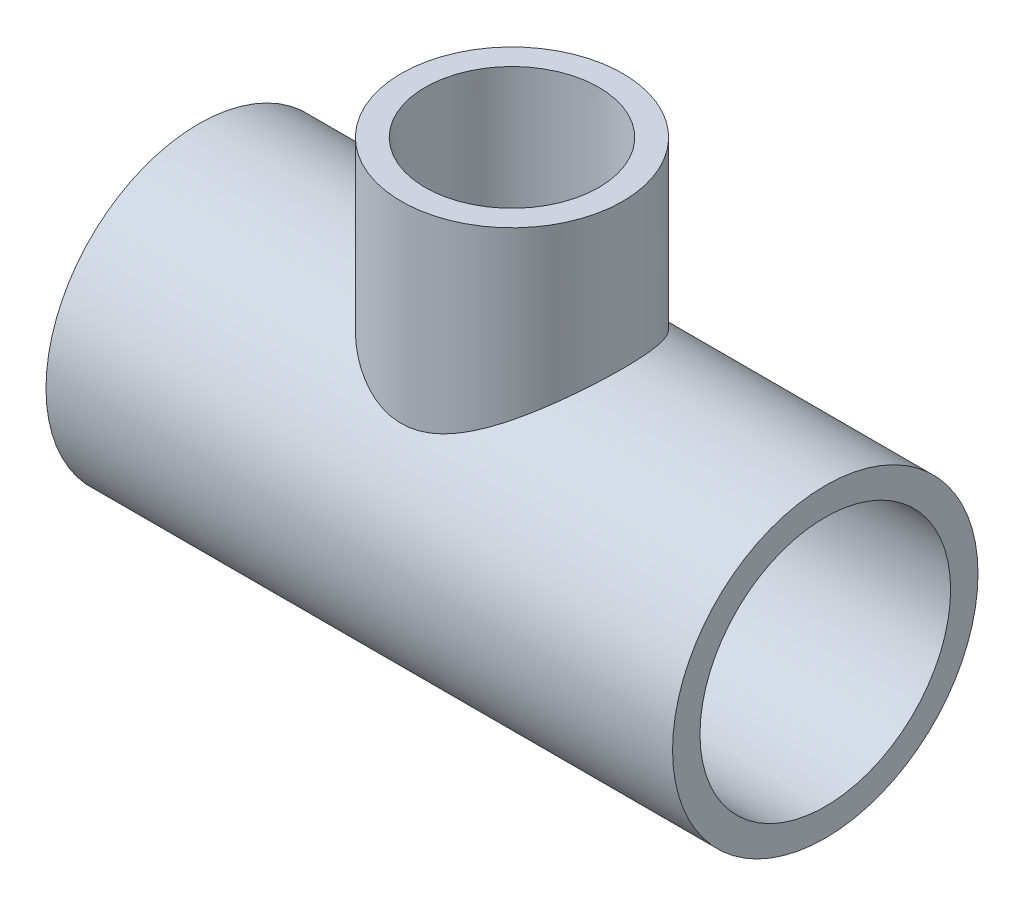
ISO-10303-21;
HEADER;
FILE_DESCRIPTION(('STEP AP214'),'2;1');
FILE_NAME('part.step','',(''),(''),'','','');
FILE_SCHEMA(('AUTOMOTIVE_DESIGN { 1 0 10303 214 1 1 1 1 }'));
ENDSEC;
DATA;
#1=APPLICATION_CONTEXT('core data for automotive mechanical design processes');
#2=APPLICATION_PROTOCOL_DEFINITION('international standard','automotive_design',2000,#1);
#3=PRODUCT_CONTEXT('',#1,'mechanical');
#4=PRODUCT('Part','Part','',(#3));
#5=PRODUCT_RELATED_PRODUCT_CATEGORY('part','',(#4));
#6=PRODUCT_DEFINITION_FORMATION('','',#4);
#7=PRODUCT_DEFINITION_CONTEXT('part definition',#1,'design');
#8=PRODUCT_DEFINITION('design','',#6,#7);
#9=PRODUCT_DEFINITION_SHAPE('','',#8);
#10=(LENGTH_UNIT() NAMED_UNIT(*) SI_UNIT(.MILLI.,.METRE.));
#11=(NAMED_UNIT(*) PLANE_ANGLE_UNIT() SI_UNIT($,.RADIAN.));
#12=(NAMED_UNIT(*) SI_UNIT($,.STERADIAN.) SOLID_ANGLE_UNIT());
#13=UNCERTAINTY_MEASURE_WITH_UNIT(LENGTH_MEASURE(1.E-05),#10,'distance_accuracy_value','');
#14=(GEOMETRIC_REPRESENTATION_CONTEXT(3) GLOBAL_UNCERTAINTY_ASSIGNED_CONTEXT((#13)) GLOBAL_UNIT_ASSIGNED_CONTEXT((#10,
#11,#12)) REPRESENTATION_CONTEXT('',''));
#15=CARTESIAN_POINT('',(0.,0.,0.));
#16=DIRECTION('',(0.,0.,1.));
#17=DIRECTION('',(1.,0.,0.));
#18=AXIS2_PLACEMENT_3D('',#15,#16,#17);
#19=CARTESIAN_POINT('',(-25.654,0.,0.));
#20=DIRECTION('',(1.,0.,0.));
#21=DIRECTION('',(0.,0.,-1.));
#22=AXIS2_PLACEMENT_3D('',#19,#20,#21);
#23=PLANE('',#22);
#24=CARTESIAN_POINT('',(-25.654,0.,0.));
#25=DIRECTION('',(-1.,0.,0.));
#26=DIRECTION('',(0.,0.,1.));
#27=AXIS2_PLACEMENT_3D('',#24,#25,#26);
#28=CIRCLE('',#27,24.0538);
#29=CARTESIAN_POINT('',(-25.654,0.,24.0538));
#30=VERTEX_POINT('',#29);
#31=EDGE_CURVE('E97',#30,#30,#28,.T.);
#32=ORIENTED_EDGE('',*,*,#31,.T.);
#33=EDGE_LOOP('',(#32));
#34=FACE_BOUND('',#33,.T.);
#35=CARTESIAN_POINT('',(-25.654,0.,0.));
#36=DIRECTION('',(1.,0.,0.));
#37=DIRECTION('',(0.,0.,-1.));
#38=AXIS2_PLACEMENT_3D('',#35,#36,#37);
#39=CIRCLE('',#38,19.05);
#40=CARTESIAN_POINT('',(-25.654,0.,-19.05));
#41=VERTEX_POINT('',#40);
#42=EDGE_CURVE('E100',#41,#41,#39,.T.);
#43=ORIENTED_EDGE('',*,*,#42,.T.);
#44=EDGE_LOOP('',(#43));
#45=FACE_BOUND('',#44,.T.);
#46=ADVANCED_FACE('F32',(#34,#45),#23,.F.);
#47=CARTESIAN_POINT('',(25.654,0.,0.));
#48=DIRECTION('',(1.,0.,0.));
#49=DIRECTION('',(0.,0.,-1.));
#50=AXIS2_PLACEMENT_3D('',#47,#48,#49);
#51=PLANE('',#50);
#52=CARTESIAN_POINT('',(25.654,0.,0.));
#53=DIRECTION('',(1.,0.,0.));
#54=DIRECTION('',(0.,0.,-1.));
#55=AXIS2_PLACEMENT_3D('',#52,#53,#54);
#56=CIRCLE('',#55,24.0538);
#57=CARTESIAN_POINT('',(25.654,0.,-24.0538));
#58=VERTEX_POINT('',#57);
#59=EDGE_CURVE('E10',#58,#58,#56,.F.);
#60=ORIENTED_EDGE('',*,*,#59,.F.);
#61=EDGE_LOOP('',(#60));
#62=FACE_BOUND('',#61,.T.);
#63=CARTESIAN_POINT('',(25.654,0.,0.));
#64=DIRECTION('',(1.,0.,0.));
#65=DIRECTION('',(0.,0.,-1.));
#66=AXIS2_PLACEMENT_3D('',#63,#64,#65);
#67=CIRCLE('',#66,19.05);
#68=CARTESIAN_POINT('',(25.654,0.,-19.05));
#69=VERTEX_POINT('',#68);
#70=EDGE_CURVE('E103',#69,#69,#67,.T.);
#71=ORIENTED_EDGE('',*,*,#70,.F.);
#72=EDGE_LOOP('',(#71));
#73=FACE_BOUND('',#72,.T.);
#74=ADVANCED_FACE('F73',(#62,#73),#51,.T.);
#75=CARTESIAN_POINT('',(25.654,0.,0.));
#76=DIRECTION('',(-1.,0.,0.));
#77=DIRECTION('',(0.,0.,1.));
#78=AXIS2_PLACEMENT_3D('',#75,#76,#77);
#79=CYLINDRICAL_SURFACE('',#78,29.591);
#80=CARTESIAN_POINT('',(-60.706,0.,0.));
#81=DIRECTION('',(-1.,0.,0.));
#82=DIRECTION('',(0.,0.,1.));
#83=AXIS2_PLACEMENT_3D('',#80,#81,#82);
#84=CIRCLE('',#83,29.591);
#85=CARTESIAN_POINT('',(-60.706,0.,29.591));
#86=VERTEX_POINT('',#85);
#87=EDGE_CURVE('E114',#86,#86,#84,.T.);
#88=ORIENTED_EDGE('',*,*,#87,.F.);
#89=EDGE_LOOP('',(#88));
#90=FACE_BOUND('',#89,.T.);
#91=CARTESIAN_POINT('',(60.706,0.,0.));
#92=DIRECTION('',(-1.,0.,0.));
#93=DIRECTION('',(0.,0.,1.));
#94=AXIS2_PLACEMENT_3D('',#91,#92,#93);
#95=CIRCLE('',#94,29.591);
#96=CARTESIAN_POINT('',(60.706,0.,29.591));
#97=VERTEX_POINT('',#96);
#98=EDGE_CURVE('E102',#97,#97,#95,.T.);
#99=ORIENTED_EDGE('',*,*,#98,.T.);
#100=EDGE_LOOP('',(#99));
#101=FACE_BOUND('',#100,.T.);
#102=CARTESIAN_POINT('',(21.463,29.591,0.));
#103=CARTESIAN_POINT('',(21.462994898184,29.5909951098971,-0.528338398891371));
#104=CARTESIAN_POINT('',(21.4434549580489,29.5768140730782,-1.05684835625253));
#105=CARTESIAN_POINT('',(21.3655887204457,29.5204097931558,-2.10973586915896));
#106=CARTESIAN_POINT('',(21.3072371146965,29.4781682524034,-2.63411050223786));
#107=CARTESIAN_POINT('',(21.152501873962,29.3665178540433,-3.67556796864868));
#108=CARTESIAN_POINT('',(21.0560282203728,29.2970446968459,-4.19263052053947));
#109=CARTESIAN_POINT('',(20.826557375346,29.1325593081479,-5.21430839745557));
#110=CARTESIAN_POINT('',(20.693565673549,29.0375509153227,-5.71892558093717));
#111=CARTESIAN_POINT('',(20.393821315668,28.8247080893867,-6.70959467389816));
#112=CARTESIAN_POINT('',(20.2272761479536,28.7070141242889,-7.19573985653992));
#113=CARTESIAN_POINT('',(19.8619688391845,28.4507955926621,-8.15007104952323));
#114=CARTESIAN_POINT('',(19.6632055890514,28.3122703090456,-8.6182564409287));
#115=CARTESIAN_POINT('',(19.2356833404562,28.0170400727261,-9.53437191154692));
#116=CARTESIAN_POINT('',(19.0069415278178,27.8603455418026,-9.98231339961891));
#117=CARTESIAN_POINT('',(18.5213753412148,27.5313705809405,-10.8567582925783));
#118=CARTESIAN_POINT('',(18.26454734661,27.3590881420319,-11.2832589231172));
#119=CARTESIAN_POINT('',(17.7002038596691,26.9854666491948,-12.1513344305822));
#120=CARTESIAN_POINT('',(17.3902038664464,26.7829094067858,-12.5907688832024));
#121=CARTESIAN_POINT('',(16.7411668375511,26.3661085910305,-13.4417302260415));
#122=CARTESIAN_POINT('',(16.4021282937812,26.1518644109412,-13.8532556648338));
#123=CARTESIAN_POINT('',(15.6962612398346,25.7150253982496,-14.6482331736497));
#124=CARTESIAN_POINT('',(15.3293925684097,25.4924187408655,-15.0316430399665));
#125=CARTESIAN_POINT('',(14.5696925821668,25.0429445292475,-15.7691066775834));
#126=CARTESIAN_POINT('',(14.1768598565041,24.8160767439512,-16.1231588512734));
#127=CARTESIAN_POINT('',(13.289184255793,24.3189117857586,-16.8657482348943));
#128=CARTESIAN_POINT('',(12.7891409340898,24.0485531556858,-17.2480558518447));
#129=CARTESIAN_POINT('',(11.7547684682521,23.5147850027712,-17.9689569027365));
#130=CARTESIAN_POINT('',(11.2204297045283,23.2513774591464,-18.3075379908223));
#131=CARTESIAN_POINT('',(10.1187913652936,22.7402522517455,-18.9386580710896));
#132=CARTESIAN_POINT('',(9.55153116636302,22.4925165557139,-19.2312505761355));
#133=CARTESIAN_POINT('',(8.67657734150166,22.1399826320625,-19.633653337645));
#134=CARTESIAN_POINT('',(8.38097220422471,22.0256689163657,-19.7616863448059));
#135=CARTESIAN_POINT('',(7.78173806257959,21.8046955716815,-20.005238012482));
#136=CARTESIAN_POINT('',(7.47810725814735,21.6980376800836,-20.1207538353976));
#137=CARTESIAN_POINT('',(6.75764830732772,21.4588216710486,-20.376125626886));
#138=CARTESIAN_POINT('',(6.33771580458096,21.3299282047603,-20.510739672188));
#139=CARTESIAN_POINT('',(5.48516758724139,21.0923326928021,-20.754995561069));
#140=CARTESIAN_POINT('',(5.05255586466913,20.9836243693076,-20.8646451712981));
#141=CARTESIAN_POINT('',(4.17698529656823,20.7901961053962,-21.0573901662103));
#142=CARTESIAN_POINT('',(3.73404680101495,20.7054326975939,-21.1405337033079));
#143=CARTESIAN_POINT('',(2.83951001158589,20.5629486277632,-21.2791530804589));
#144=CARTESIAN_POINT('',(2.38791174413444,20.5052278832307,-21.3346290049232));
#145=CARTESIAN_POINT('',(1.47593750783051,20.4190554885241,-21.4171213147156));
#146=CARTESIAN_POINT('',(1.01552147065251,20.3908213656471,-21.4439262241409));
#147=CARTESIAN_POINT('',(0.093069778909439,20.3657317584442,-21.4677563511466));
#148=CARTESIAN_POINT('',(-0.368965817402683,20.3688751568644,-21.4647826290495));
#149=CARTESIAN_POINT('',(-1.29089635472747,20.4063966424321,-21.4291135995591));
#150=CARTESIAN_POINT('',(-1.75078971667662,20.4407949444887,-21.3963990565213));
#151=CARTESIAN_POINT('',(-2.66436789567,20.5392156071928,-21.3019364997843));
#152=CARTESIAN_POINT('',(-3.11805200989045,20.6032412932702,-21.2401852269388));
#153=CARTESIAN_POINT('',(-4.06868357863185,20.7672086676957,-21.0799654299764));
#154=CARTESIAN_POINT('',(-4.56447161279031,20.8704796520284,-20.9780425016255));
#155=CARTESIAN_POINT('',(-5.54117129596461,21.1056048075456,-20.7414668129513));
#156=CARTESIAN_POINT('',(-6.02208075425491,21.2374631652704,-20.6068092583834));
#157=CARTESIAN_POINT('',(-6.96788846142878,21.5247508459499,-20.3065403575941));
#158=CARTESIAN_POINT('',(-7.43275452157071,21.6802245182848,-20.1408706317676));
#159=CARTESIAN_POINT('',(-8.34438865272373,22.0094298033233,-19.7805926338878));
#160=CARTESIAN_POINT('',(-8.79115503746355,22.1831631118063,-19.5859816733534));
#161=CARTESIAN_POINT('',(-9.81157612201469,22.6042409412502,-19.1000090970354));
#162=CARTESIAN_POINT('',(-10.3780056929205,22.8568483008802,-18.7979977004158));
#163=CARTESIAN_POINT('',(-11.4769469100737,23.3763281131634,-18.1479428456065));
#164=CARTESIAN_POINT('',(-12.009448085012,23.6432049235008,-17.7998852771869));
#165=CARTESIAN_POINT('',(-13.0401032266237,24.1830187293748,-17.0592807382828));
#166=CARTESIAN_POINT('',(-13.5382262427366,24.4559609007136,-16.6666944979559));
#167=CARTESIAN_POINT('',(-14.4982844251868,25.0002174639955,-15.8386211531588));
#168=CARTESIAN_POINT('',(-14.9602235285285,25.2715320300563,-15.4031387276969));
#169=CARTESIAN_POINT('',(-15.8514660727378,25.8090694429281,-14.4846734738015));
#170=CARTESIAN_POINT('',(-16.2803013365743,26.075189450238,-14.0011748943262));
#171=CARTESIAN_POINT('',(-17.0961623730819,26.5922196163111,-12.9924011238476));
#172=CARTESIAN_POINT('',(-17.4831838018554,26.8431281936243,-12.4671216021866));
#173=CARTESIAN_POINT('',(-18.2110726892991,27.3227983110536,-11.3774067505265));
#174=CARTESIAN_POINT('',(-18.5520284686272,27.5516019852173,-10.8130495798362));
#175=CARTESIAN_POINT('',(-19.0260260649346,27.873701250264,-9.93884405992921));
#176=CARTESIAN_POINT('',(-19.1777736188596,27.9775413393807,-9.64285923542252));
#177=CARTESIAN_POINT('',(-19.4683130834439,28.1774910744256,-9.04193293893156));
#178=CARTESIAN_POINT('',(-19.6071017590167,28.2735987892007,-8.7369892552808));
#179=CARTESIAN_POINT('',(-19.9353369744799,28.502011802463,-7.96821149907086));
#180=CARTESIAN_POINT('',(-20.1165600580087,28.6291668603385,-7.49928417472359));
#181=CARTESIAN_POINT('',(-20.4468860859633,28.8622308533619,-6.54522766926353));
#182=CARTESIAN_POINT('',(-20.5959960561431,28.9681444354017,-6.06010205891689));
#183=CARTESIAN_POINT('',(-20.8602235544712,29.1565989399981,-5.07647424546999));
#184=CARTESIAN_POINT('',(-20.9753588542245,29.2391520810958,-4.57797918511645));
#185=CARTESIAN_POINT('',(-21.1701300698223,29.3791887743654,-3.57059365634574));
#186=CARTESIAN_POINT('',(-21.2497650373803,29.4366716568586,-3.06170291061822));
#187=CARTESIAN_POINT('',(-21.3725456067003,29.5254264450639,-2.03536631348798));
#188=CARTESIAN_POINT('',(-21.4155579247295,29.556602606968,-1.51789614178391));
#189=CARTESIAN_POINT('',(-21.4639104784338,29.591655681319,-0.480269382437619));
#190=CARTESIAN_POINT('',(-21.4692507820878,29.5955326430271,0.0398872003552916));
#191=CARTESIAN_POINT('',(-21.4421719265362,29.5758949794748,1.07871779242878));
#192=CARTESIAN_POINT('',(-21.4097508192103,29.5523789410028,1.59739172383509));
#193=CARTESIAN_POINT('',(-21.307671548072,29.4785097674091,2.62910828155284));
#194=CARTESIAN_POINT('',(-21.2380143088428,29.4281572986433,3.14215104736485));
#195=CARTESIAN_POINT('',(-21.0673909886555,29.3052654873037,4.13074101265705));
#196=CARTESIAN_POINT('',(-20.9683612559213,29.2341013349043,4.60679673649069));
#197=CARTESIAN_POINT('',(-20.7393162465803,29.0702553689707,5.54756751477126));
#198=CARTESIAN_POINT('',(-20.6093023678533,28.9775745261879,6.01228307979811));
#199=CARTESIAN_POINT('',(-20.3198001556261,28.7723958752542,6.92796586121283));
#200=CARTESIAN_POINT('',(-20.1603090603114,28.6598962102609,7.37893178473686));
#201=CARTESIAN_POINT('',(-19.8135183403861,28.4170214102731,8.26506383479821));
#202=CARTESIAN_POINT('',(-19.626217120254,28.2866452497017,8.70022905303406));
#203=CARTESIAN_POINT('',(-19.2085402478339,27.9983960574037,9.58924020664078));
#204=CARTESIAN_POINT('',(-18.9758608863453,27.8391298384146,10.041551225252));
#205=CARTESIAN_POINT('',(-18.4818750726598,27.5047915186246,10.9241229311115));
#206=CARTESIAN_POINT('',(-18.2205673101399,27.3297186944194,11.3543826077448));
#207=CARTESIAN_POINT('',(-17.6711156110548,26.9665109253082,12.1919243884052));
#208=CARTESIAN_POINT('',(-17.3829585111598,26.7783695849735,12.5991950629027));
#209=CARTESIAN_POINT('',(-16.7815884770429,26.3919597247862,13.3897488383642));
#210=CARTESIAN_POINT('',(-16.4683725162831,26.1936899827026,13.7730290318324));
#211=CARTESIAN_POINT('',(-15.7589403025303,25.7530629952212,14.5827447507522));
#212=CARTESIAN_POINT('',(-15.3580124945434,25.5092669663652,15.0042783104633));
#213=CARTESIAN_POINT('',(-14.5249449069062,25.0165560457254,15.8121188340798));
#214=CARTESIAN_POINT('',(-14.0928001524178,24.767640342594,16.1984201609652));
#215=CARTESIAN_POINT('',(-13.1983146062519,24.2698207725823,16.9351961742652));
#216=CARTESIAN_POINT('',(-12.7359510702154,24.0209170590659,17.2856433538582));
#217=CARTESIAN_POINT('',(-11.7822340326979,23.5291518028672,17.9492835691786));
#218=CARTESIAN_POINT('',(-11.2908846875044,23.2862894009844,18.2624819266993));
#219=CARTESIAN_POINT('',(-10.3435307133612,22.843011274543,18.8131029116856));
#220=CARTESIAN_POINT('',(-9.89088173495633,22.6411047387762,19.0551006414421));
#221=CARTESIAN_POINT('',(-8.96421457273159,22.2519047927876,19.5081826631475));
#222=CARTESIAN_POINT('',(-8.49019593768948,22.064611691358,19.7192663019423));
#223=CARTESIAN_POINT('',(-7.52232226098752,21.7105911788802,20.1083715613389));
#224=CARTESIAN_POINT('',(-7.02850254826888,21.5438291271725,20.286449134835));
#225=CARTESIAN_POINT('',(-6.02165946927496,21.2367082294359,20.6077405189533));
#226=CARTESIAN_POINT('',(-5.50864160834843,21.0963418825742,20.7509642373623));
#227=CARTESIAN_POINT('',(-4.57584937305037,20.8745197120726,20.9738158119024));
#228=CARTESIAN_POINT('',(-4.15922174834,20.786882971641,21.0604854431327));
#229=CARTESIAN_POINT('',(-3.3174109286651,20.6349432093199,21.2093789975856));
#230=CARTESIAN_POINT('',(-2.89222886297836,20.5706371285898,21.2716061255092));
#231=CARTESIAN_POINT('',(-2.03629066410494,20.4678564151549,21.3705229440428));
#232=CARTESIAN_POINT('',(-1.60554170056596,20.4293513900046,21.4072426830506));
#233=CARTESIAN_POINT('',(-0.741015617219681,20.3796424639612,21.4545718463691));
#234=CARTESIAN_POINT('',(-0.307238474585814,20.3684387690902,21.465181073644));
#235=CARTESIAN_POINT('',(0.560531930995597,20.3738219103336,21.4600716189812));
#236=CARTESIAN_POINT('',(0.994524779155128,20.3904437306183,21.4443197941054));
#237=CARTESIAN_POINT('',(1.85884476408972,20.4508266446947,21.3867408774447));
#238=CARTESIAN_POINT('',(2.2891719134629,20.4945876451773,21.3449138753105));
#239=CARTESIAN_POINT('',(3.14378393548573,20.6075370780363,21.2358854026239));
#240=CARTESIAN_POINT('',(3.56805982641957,20.6767598994717,21.1686496112559));
#241=CARTESIAN_POINT('',(4.40761230361976,20.8380446152876,21.009900981429));
#242=CARTESIAN_POINT('',(4.82288764496501,20.9301096474684,20.9183848074905));
#243=CARTESIAN_POINT('',(5.7698776741133,21.1657236422647,20.6803166118492));
#244=CARTESIAN_POINT('',(6.29775488730075,21.3163841509236,20.5254984952194));
#245=CARTESIAN_POINT('',(7.33259200445711,21.6446913030733,20.1789867586553));
#246=CARTESIAN_POINT('',(7.83954471275125,21.8223471332,19.9872805796017));
#247=CARTESIAN_POINT('',(8.83178618821935,22.1981131278564,19.5691121082435));
#248=CARTESIAN_POINT('',(9.31704653881634,22.3962490575382,19.3426058569205));
#249=CARTESIAN_POINT('',(10.2645329447587,22.8066922529373,18.8569127386146));
#250=CARTESIAN_POINT('',(10.726760592324,23.0189985366966,18.5977281350274));
#251=CARTESIAN_POINT('',(11.6408919632155,23.4587315893669,18.0400915223768));
#252=CARTESIAN_POINT('',(12.092108061282,23.686418264774,17.7407190605326));
#253=CARTESIAN_POINT('',(12.9692683801336,24.14600000093,17.1099464548335));
#254=CARTESIAN_POINT('',(13.3952126309301,24.377895056681,16.7785463490142));
#255=CARTESIAN_POINT('',(14.2212401740862,24.8413706178257,16.0843964662998));
#256=CARTESIAN_POINT('',(14.6213143523719,25.0729509845271,15.7216357450544));
#257=CARTESIAN_POINT('',(15.3943586480519,25.5314784034304,14.9655089630586));
#258=CARTESIAN_POINT('',(15.7673258783461,25.7584249602501,14.5721396514679));
#259=CARTESIAN_POINT('',(16.5602368512578,26.2505687066181,13.6693769142588));
#260=CARTESIAN_POINT('',(16.9735278766795,26.5137537843595,13.1529974690632));
#261=CARTESIAN_POINT('',(17.754736020013,27.0205339322182,12.0777211632406));
#262=CARTESIAN_POINT('',(18.1226430788646,27.2641246552269,11.5188149210502));
#263=CARTESIAN_POINT('',(18.8083286226154,27.7246407310116,10.3614228681583));
#264=CARTESIAN_POINT('',(19.1261570698907,27.9415926124722,9.76297736214499));
#265=CARTESIAN_POINT('',(19.7070784053979,28.3424000098243,8.52967960868711));
#266=CARTESIAN_POINT('',(19.9701998681735,28.5262727967869,7.89484658933708));
#267=CARTESIAN_POINT('',(20.3703457692117,28.8080535496615,6.7789487449367));
#268=CARTESIAN_POINT('',(20.5219531384028,28.9155401001343,6.30547250269838));
#269=CARTESIAN_POINT('',(20.7928226776772,29.1084062387235,5.34488265388064));
#270=CARTESIAN_POINT('',(20.9120856615745,29.1937863830545,4.85776939076124));
#271=CARTESIAN_POINT('',(21.1163947602121,29.3404840445707,3.87425849252742));
#272=CARTESIAN_POINT('',(21.2015322162939,29.4018657855597,3.37788941425984));
#273=CARTESIAN_POINT('',(21.336797718217,29.4995532265577,2.37814764524219));
#274=CARTESIAN_POINT('',(21.3869454379337,29.5358730181628,1.87477905281561));
#275=CARTESIAN_POINT('',(21.4338156578844,29.5698375115704,1.14197799141485));
#276=CARTESIAN_POINT('',(21.4447543268099,29.5777682339482,0.91381970457764));
#277=CARTESIAN_POINT('',(21.4593480977819,29.5883508956713,0.457118347432673));
#278=CARTESIAN_POINT('',(21.4630022072005,29.5910021156069,0.228575228931997));
#279=CARTESIAN_POINT('',(21.463,29.591,0.));
#280=B_SPLINE_CURVE_WITH_KNOTS('',3,(#102,#103,#104,#105,#106,#107,#108,#109,#110,#111,#112,
#113,#114,#115,#116,#117,#118,#119,#120,#121,#122,#123,#124,#125,#126,#127,#128,#129,#130,#131,
#132,#133,#134,#135,#136,#137,#138,#139,#140,#141,#142,#143,#144,#145,#146,#147,#148,#149,#150,
#151,#152,#153,#154,#155,#156,#157,#158,#159,#160,#161,#162,#163,#164,#165,#166,#167,#168,#169,
#170,#171,#172,#173,#174,#175,#176,#177,#178,#179,#180,#181,#182,#183,#184,#185,#186,#187,#188,
#189,#190,#191,#192,#193,#194,#195,#196,#197,#198,#199,#200,#201,#202,#203,#204,#205,#206,#207,
#208,#209,#210,#211,#212,#213,#214,#215,#216,#217,#218,#219,#220,#221,#222,#223,#224,#225,#226,
#227,#228,#229,#230,#231,#232,#233,#234,#235,#236,#237,#238,#239,#240,#241,#242,#243,#244,#245,
#246,#247,#248,#249,#250,#251,#252,#253,#254,#255,#256,#257,#258,#259,#260,#261,#262,#263,#264,
#265,#266,#267,#268,#269,#270,#271,#272,#273,#274,#275,#276,#277,#278,#279),.UNSPECIFIED.,.T.,
.F.,(4,2,2,2,2,2,2,2,2,2,2,2,2,2,2,2,2,2,2,2,2,2,2,2,2,2,2,2,2,2,2,2,2,2,2,2,2,2,2,2,2,2,2,2,2,
2,2,2,2,2,2,2,2,2,2,2,2,2,2,2,2,2,2,2,2,2,2,2,2,2,2,2,2,2,2,2,2,2,2,2,2,2,2,2,2,2,2,2,4),(0.,
1.58476630719042,3.17056702201728,4.7601349239033,6.34946400185304,7.92925103960969,
9.50909247167217,11.0880321568608,12.6671756264784,14.3895234574232,16.1119607916222,
17.8369328490236,19.5619987157936,21.6148351383492,23.6682499025092,25.7192573113527,
26.7443830269793,27.7697406507799,29.1468010226215,30.5234323919602,31.8975484532957,
33.2716603223338,34.6558391185171,36.0399686286661,37.4249939977443,38.8101748622383,
40.3576583229417,41.9053685615061,43.4560221702915,45.0068199163268,47.0734644561256,
49.1407437646375,51.2098605942416,53.2787519791757,55.3729435186127,57.4673524077381,
59.5576869539793,60.6026610264485,61.6478952752367,63.2018798034921,64.755524002572,
66.3083540687885,67.8612256117887,69.4197247778177,70.9782211315492,72.5367978920497,
74.0953359544672,75.5680085254443,77.0406146679356,78.5133588536033,79.9861875661762,
81.5836379116233,83.1811614030033,84.7794722694967,86.3779764676836,88.2684089667056,
90.1591433989059,92.051317668244,93.9432212743061,95.5965650175223,97.2499436876072,
98.9004933381818,100.550573243093,101.852740058821,103.154736088064,104.455195717543,
105.755665160559,107.057770872362,108.359872107332,109.663738473302,110.967784048703,
112.676321368181,114.385441418548,116.096738433187,117.80791698357,119.568696574964,
121.329474075314,123.090868558601,124.852450369965,126.985085193464,129.118191855495,
131.249156699465,133.379005686422,134.903404854964,136.42776566469,137.948018635807,
139.467416115395,140.15294071866,140.83855872831),.UNSPECIFIED.);
#281=CARTESIAN_POINT('',(21.463,29.591,0.));
#282=VERTEX_POINT('',#281);
#283=EDGE_CURVE('E57',#282,#282,#280,.T.);
#284=ORIENTED_EDGE('',*,*,#283,.F.);
#285=EDGE_LOOP('',(#284));
#286=FACE_BOUND('',#285,.T.);
#287=ADVANCED_FACE('F69',(#90,#101,#286),#79,.T.);
#288=CARTESIAN_POINT('',(0.,0.,0.));
#289=DIRECTION('',(0.,-1.,0.));
#290=DIRECTION('',(1.,0.,0.));
#291=AXIS2_PLACEMENT_3D('',#288,#289,#290);
#292=CYLINDRICAL_SURFACE('',#291,21.463);
#293=CARTESIAN_POINT('',(0.,57.658,0.));
#294=DIRECTION('',(0.,-1.,0.));
#295=DIRECTION('',(1.,0.,0.));
#296=AXIS2_PLACEMENT_3D('',#293,#294,#295);
#297=CIRCLE('',#296,21.463);
#298=CARTESIAN_POINT('',(21.463,57.658,0.));
#299=VERTEX_POINT('',#298);
#300=EDGE_CURVE('E45',#299,#299,#297,.T.);
#301=ORIENTED_EDGE('',*,*,#300,.T.);
#302=EDGE_LOOP('',(#301));
#303=FACE_BOUND('',#302,.T.);
#304=ORIENTED_EDGE('',*,*,#283,.T.);
#305=EDGE_LOOP('',(#304));
#306=FACE_BOUND('',#305,.T.);
#307=ADVANCED_FACE('F66',(#303,#306),#292,.T.);
#308=CARTESIAN_POINT('',(0.,57.658,0.));
#309=DIRECTION('',(0.,1.,0.));
#310=DIRECTION('',(-1.,0.,0.));
#311=AXIS2_PLACEMENT_3D('',#308,#309,#310);
#312=CONICAL_SURFACE('',#311,16.8275,0.00599992800155515);
#313=CARTESIAN_POINT('',(0.,57.658,0.));
#314=DIRECTION('',(0.,-1.,0.));
#315=DIRECTION('',(1.,0.,0.));
#316=AXIS2_PLACEMENT_3D('',#313,#314,#315);
#317=CIRCLE('',#316,16.8275);
#318=CARTESIAN_POINT('',(16.8275,57.658,0.));
#319=VERTEX_POINT('',#318);
#320=EDGE_CURVE('E54',#319,#319,#317,.T.);
#321=ORIENTED_EDGE('',*,*,#320,.F.);
#322=EDGE_LOOP('',(#321));
#323=FACE_BOUND('',#322,.T.);
#324=CARTESIAN_POINT('',(0.,25.908,0.));
#325=DIRECTION('',(0.,-1.,0.));
#326=DIRECTION('',(1.,0.,0.));
#327=AXIS2_PLACEMENT_3D('',#324,#325,#326);
#328=CIRCLE('',#327,16.637);
#329=CARTESIAN_POINT('',(16.637,25.908,0.));
#330=VERTEX_POINT('',#329);
#331=EDGE_CURVE('E49',#330,#330,#328,.T.);
#332=ORIENTED_EDGE('',*,*,#331,.T.);
#333=EDGE_LOOP('',(#332));
#334=FACE_BOUND('',#333,.T.);
#335=ADVANCED_FACE('F76',(#323,#334),#312,.F.);
#336=CARTESIAN_POINT('',(21.463,57.658,0.));
#337=DIRECTION('',(0.,1.,0.));
#338=DIRECTION('',(-1.,0.,0.));
#339=AXIS2_PLACEMENT_3D('',#336,#337,#338);
#340=PLANE('',#339);
#341=ORIENTED_EDGE('',*,*,#320,.T.);
#342=EDGE_LOOP('',(#341));
#343=FACE_BOUND('',#342,.T.);
#344=ORIENTED_EDGE('',*,*,#300,.F.);
#345=EDGE_LOOP('',(#344));
#346=FACE_BOUND('',#345,.T.);
#347=ADVANCED_FACE('F34',(#343,#346),#340,.T.);
#348=CARTESIAN_POINT('',(-60.706,-29.591,0.));
#349=DIRECTION('',(-1.,0.,0.));
#350=DIRECTION('',(0.,0.,1.));
#351=AXIS2_PLACEMENT_3D('',#348,#349,#350);
#352=PLANE('',#351);
#353=ORIENTED_EDGE('',*,*,#87,.T.);
#354=EDGE_LOOP('',(#353));
#355=FACE_BOUND('',#354,.T.);
#356=CARTESIAN_POINT('',(-60.706,0.,0.));
#357=DIRECTION('',(-1.,0.,0.));
#358=DIRECTION('',(0.,0.,1.));
#359=AXIS2_PLACEMENT_3D('',#356,#357,#358);
#360=CIRCLE('',#359,24.2824);
#361=CARTESIAN_POINT('',(-60.706,0.,24.2824));
#362=VERTEX_POINT('',#361);
#363=EDGE_CURVE('E64',#362,#362,#360,.T.);
#364=ORIENTED_EDGE('',*,*,#363,.F.);
#365=EDGE_LOOP('',(#364));
#366=FACE_BOUND('',#365,.T.);
#367=ADVANCED_FACE('F83',(#355,#366),#352,.T.);
#368=CARTESIAN_POINT('',(-25.654,0.,0.));
#369=DIRECTION('',(-1.,0.,0.));
#370=DIRECTION('',(0.,0.,1.));
#371=AXIS2_PLACEMENT_3D('',#368,#369,#370);
#372=CONICAL_SURFACE('',#371,24.0538,0.00652164666957424);
#373=ORIENTED_EDGE('',*,*,#363,.T.);
#374=EDGE_LOOP('',(#373));
#375=FACE_BOUND('',#374,.T.);
#376=ORIENTED_EDGE('',*,*,#31,.F.);
#377=EDGE_LOOP('',(#376));
#378=FACE_BOUND('',#377,.T.);
#379=ADVANCED_FACE('F119',(#375,#378),#372,.F.);
#380=CARTESIAN_POINT('',(60.706,-29.591,0.));
#381=DIRECTION('',(1.,0.,0.));
#382=DIRECTION('',(0.,0.,-1.));
#383=AXIS2_PLACEMENT_3D('',#380,#381,#382);
#384=PLANE('',#383);
#385=CARTESIAN_POINT('',(60.706,0.,0.));
#386=DIRECTION('',(-1.,0.,0.));
#387=DIRECTION('',(0.,0.,1.));
#388=AXIS2_PLACEMENT_3D('',#385,#386,#387);
#389=CIRCLE('',#388,24.2824);
#390=CARTESIAN_POINT('',(60.706,0.,24.2824));
#391=VERTEX_POINT('',#390);
#392=EDGE_CURVE('E106',#391,#391,#389,.T.);
#393=ORIENTED_EDGE('',*,*,#392,.T.);
#394=EDGE_LOOP('',(#393));
#395=FACE_BOUND('',#394,.T.);
#396=ORIENTED_EDGE('',*,*,#98,.F.);
#397=EDGE_LOOP('',(#396));
#398=FACE_BOUND('',#397,.T.);
#399=ADVANCED_FACE('F128',(#395,#398),#384,.T.);
#400=CARTESIAN_POINT('',(60.706,0.,0.));
#401=DIRECTION('',(1.,0.,0.));
#402=DIRECTION('',(0.,0.,-1.));
#403=AXIS2_PLACEMENT_3D('',#400,#401,#402);
#404=CONICAL_SURFACE('',#403,24.2824,0.00652164666957404);
#405=ORIENTED_EDGE('',*,*,#59,.T.);
#406=EDGE_LOOP('',(#405));
#407=FACE_BOUND('',#406,.T.);
#408=ORIENTED_EDGE('',*,*,#392,.F.);
#409=EDGE_LOOP('',(#408));
#410=FACE_BOUND('',#409,.T.);
#411=ADVANCED_FACE('F133',(#407,#410),#404,.F.);
#412=CARTESIAN_POINT('',(0.,25.908,0.));
#413=DIRECTION('',(0.,-1.,0.));
#414=DIRECTION('',(1.,0.,0.));
#415=AXIS2_PLACEMENT_3D('',#412,#413,#414);
#416=PLANE('',#415);
#417=ORIENTED_EDGE('',*,*,#331,.F.);
#418=EDGE_LOOP('',(#417));
#419=FACE_BOUND('',#418,.T.);
#420=CARTESIAN_POINT('',(0.,25.908,0.));
#421=DIRECTION('',(0.,-1.,0.));
#422=DIRECTION('',(1.,0.,0.));
#423=AXIS2_PLACEMENT_3D('',#420,#421,#422);
#424=CIRCLE('',#423,12.1539);
#425=CARTESIAN_POINT('',(12.1539,25.908,0.));
#426=VERTEX_POINT('',#425);
#427=EDGE_CURVE('E155',#426,#426,#424,.T.);
#428=ORIENTED_EDGE('',*,*,#427,.T.);
#429=EDGE_LOOP('',(#428));
#430=FACE_BOUND('',#429,.T.);
#431=ADVANCED_FACE('F137',(#419,#430),#416,.F.);
#432=CARTESIAN_POINT('',(60.706,0.,0.));
#433=DIRECTION('',(1.,0.,0.));
#434=DIRECTION('',(0.,0.,-1.));
#435=AXIS2_PLACEMENT_3D('',#432,#433,#434);
#436=CYLINDRICAL_SURFACE('',#435,19.05);
#437=CARTESIAN_POINT('',(12.1539,19.05,0.));
#438=CARTESIAN_POINT('',(12.1539007636458,19.0500006511001,0.307762401804011));
#439=CARTESIAN_POINT('',(12.1421958265105,19.0425263932329,0.615517531414034));
#440=CARTESIAN_POINT('',(12.0955466550267,19.0128151472272,1.22865714853317));
#441=CARTESIAN_POINT('',(12.0605936039872,18.9905725583039,1.53404069216563));
#442=CARTESIAN_POINT('',(11.9678835314086,18.9318294306404,2.14038819273717));
#443=CARTESIAN_POINT('',(11.9100927064517,18.8953077575161,2.44134490925504));
#444=CARTESIAN_POINT('',(11.7725138935592,18.8088924664704,3.03618057843933));
#445=CARTESIAN_POINT('',(11.6927277011557,18.7589999400517,3.33006010670444));
#446=CARTESIAN_POINT('',(11.5126161211858,18.6472674615047,3.90742295900241));
#447=CARTESIAN_POINT('',(11.4123959028293,18.5854887729851,4.19095108417223));
#448=CARTESIAN_POINT('',(11.1922805459747,18.4511452062964,4.74760268505712));
#449=CARTESIAN_POINT('',(11.0723850748363,18.3785801457691,5.02072598476647));
#450=CARTESIAN_POINT('',(10.8141169876021,18.2241496937377,5.55519800879699));
#451=CARTESIAN_POINT('',(10.6757513368266,18.1422878099024,5.81655112234571));
#452=CARTESIAN_POINT('',(10.3815776778642,17.9707564316452,6.32667891038684));
#453=CARTESIAN_POINT('',(10.2257632180093,17.8810840520469,6.57544888260138));
#454=CARTESIAN_POINT('',(9.88443244576681,17.6880135809254,7.07921101123499));
#455=CARTESIAN_POINT('',(9.69753118349257,17.5840923102872,7.33306415399333));
#456=CARTESIAN_POINT('',(9.30578467946126,17.3711200756782,7.82421551796747));
#457=CARTESIAN_POINT('',(9.10093877215303,17.262068921514,8.06151312456605));
#458=CARTESIAN_POINT('',(8.67401178515524,17.0408424183373,8.51920681554258));
#459=CARTESIAN_POINT('',(8.45190623967581,16.9286627844737,8.73957799368989));
#460=CARTESIAN_POINT('',(7.9916454127639,16.7036319648318,9.16234229144723));
#461=CARTESIAN_POINT('',(7.75349402618243,16.5907809480402,9.36473974641653));
#462=CARTESIAN_POINT('',(7.22672607790111,16.3507865934147,9.77851324462649));
#463=CARTESIAN_POINT('',(6.93575601377481,16.2239000512053,9.98705370677736));
#464=CARTESIAN_POINT('',(6.33464958682215,15.976170196909,10.3787381030106));
#465=CARTESIAN_POINT('',(6.02450941979314,15.8553280929717,10.5618769727428));
#466=CARTESIAN_POINT('',(5.3865794774879,15.6240907198834,10.9010257029297));
#467=CARTESIAN_POINT('',(5.0588145210337,15.5136813343446,11.0570724680808));
#468=CARTESIAN_POINT('',(4.38668636418499,15.3077129560172,11.3405089632013));
#469=CARTESIAN_POINT('',(4.04233046432343,15.2121475082296,11.467911160325));
#470=CARTESIAN_POINT('',(3.4335594030925,15.0636089021804,11.6619399116113));
#471=CARTESIAN_POINT('',(3.17250889037748,15.0060895204827,11.7356997713187));
#472=CARTESIAN_POINT('',(2.64380486979982,14.9032796623642,11.8659873528024));
#473=CARTESIAN_POINT('',(2.37615304909055,14.8579860959185,11.9225194292972));
#474=CARTESIAN_POINT('',(1.83603981710705,14.7812350095767,12.017542647265));
#475=CARTESIAN_POINT('',(1.56358481959338,14.749760306562,12.0560561978765));
#476=CARTESIAN_POINT('',(1.01536404966713,14.7017564024276,12.1145491642087));
#477=CARTESIAN_POINT('',(0.739598239399148,14.6852273723598,12.1345283678052));
#478=CARTESIAN_POINT('',(0.186000985984356,14.66775531138,12.1556426403104));
#479=CARTESIAN_POINT('',(-0.0918341941543716,14.666860058728,12.1567199433217));
#480=CARTESIAN_POINT('',(-0.646525650210396,14.6808150529046,12.1398634704072));
#481=CARTESIAN_POINT('',(-0.923381921209428,14.6956653787301,12.1219295991006));
#482=CARTESIAN_POINT('',(-1.47418491233074,14.7405229922657,12.0673410424916));
#483=CARTESIAN_POINT('',(-1.74812941465004,14.770541091011,12.0306730039505));
#484=CARTESIAN_POINT('',(-2.29102934447632,14.8445844811431,11.9391901028621));
#485=CARTESIAN_POINT('',(-2.55998466616537,14.8886100692627,11.8843748558857));
#486=CARTESIAN_POINT('',(-3.0835927506443,14.9876475489307,11.759212801448));
#487=CARTESIAN_POINT('',(-3.33843385729158,15.0423014049242,11.6893658352702));
#488=CARTESIAN_POINT('',(-3.84093652718893,15.1617416732655,11.5340228437245));
#489=CARTESIAN_POINT('',(-4.08859572812689,15.2265313757294,11.4485217354502));
#490=CARTESIAN_POINT('',(-4.57583156066317,15.3645320154347,11.2626394105041));
#491=CARTESIAN_POINT('',(-4.81540806527738,15.4377430849013,11.1622579601866));
#492=CARTESIAN_POINT('',(-5.28587353428567,15.5909009253489,10.9473157780692));
#493=CARTESIAN_POINT('',(-5.51676209680537,15.6708480073619,10.832754391403));
#494=CARTESIAN_POINT('',(-6.0130151653003,15.8517624342987,10.5666807779234));
#495=CARTESIAN_POINT('',(-6.27645127992134,15.9538119993505,10.4123019347912));
#496=CARTESIAN_POINT('',(-6.78962358323763,16.1625883514186,10.0851815329111));
#497=CARTESIAN_POINT('',(-7.03936148762439,16.2693145496637,9.91244228179027));
#498=CARTESIAN_POINT('',(-7.52488853226043,16.4852002191642,9.54910345097944));
#499=CARTESIAN_POINT('',(-7.76066091406604,16.5943624057474,9.35848309525201));
#500=CARTESIAN_POINT('',(-8.2173036080619,16.8127657173355,8.96019018014533));
#501=CARTESIAN_POINT('',(-8.43817302769384,16.9220068466731,8.7525166010742));
#502=CARTESIAN_POINT('',(-8.90269316319152,17.157978469611,8.28175727209615));
#503=CARTESIAN_POINT('',(-9.14327566293043,17.2843127540348,8.01543028704181));
#504=CARTESIAN_POINT('',(-9.60121959543895,17.5308701645672,7.46077849770756));
#505=CARTESIAN_POINT('',(-9.81857718174021,17.6510922766659,7.17245006309971));
#506=CARTESIAN_POINT('',(-10.2281104701646,17.8821392811569,6.57525720546759));
#507=CARTESIAN_POINT('',(-10.420307737884,17.9929721921492,6.26641071593348));
#508=CARTESIAN_POINT('',(-10.7777021898977,18.2022828015659,5.6295346431128));
#509=CARTESIAN_POINT('',(-10.9429068528543,18.3007639204565,5.30151040759396));
#510=CARTESIAN_POINT('',(-11.2143367845341,18.4644876959375,4.69503987792391));
#511=CARTESIAN_POINT('',(-11.3257626943972,18.5324501823751,4.41964442161101));
#512=CARTESIAN_POINT('',(-11.5287753680377,18.657209256923,3.85919793744434));
#513=CARTESIAN_POINT('',(-11.6203656925293,18.7140078489105,3.57414865320448));
#514=CARTESIAN_POINT('',(-11.7826234230015,18.8151908998891,2.99618173041449));
#515=CARTESIAN_POINT('',(-11.853303694786,18.8595829915758,2.70326905169015));
#516=CARTESIAN_POINT('',(-11.9729187041118,18.9349898061391,2.11131992744465));
#517=CARTESIAN_POINT('',(-12.0218530337465,18.9660042780803,1.81228336716282));
#518=CARTESIAN_POINT('',(-12.0974216765309,19.0139940326861,1.20926081911123));
#519=CARTESIAN_POINT('',(-12.1239812105622,19.030922235141,0.905261668684543));
#520=CARTESIAN_POINT('',(-12.1541349983716,19.0501463661273,0.295660554240645));
#521=CARTESIAN_POINT('',(-12.1577292488826,19.0524422925771,-0.00994141000457713));
#522=CARTESIAN_POINT('',(-12.1418985121162,19.0423443387405,-0.620321645581051));
#523=CARTESIAN_POINT('',(-12.1224720029387,19.0299494872482,-0.92509986111922));
#524=CARTESIAN_POINT('',(-12.0608844798146,18.9907763071389,-1.53140376562241));
#525=CARTESIAN_POINT('',(-12.0187240300047,18.9639983354353,-1.83292953510665));
#526=CARTESIAN_POINT('',(-11.9150451799259,18.898465428774,-2.41490282813809));
#527=CARTESIAN_POINT('',(-11.8546489994395,18.8604067011354,-2.69563039875906));
#528=CARTESIAN_POINT('',(-11.7146922330246,18.7727529495281,-3.25040144673894));
#529=CARTESIAN_POINT('',(-11.6351324654302,18.7231584181706,-3.52444520896335));
#530=CARTESIAN_POINT('',(-11.4577161675156,18.6134257473175,-4.06432826657533));
#531=CARTESIAN_POINT('',(-11.3598612968236,18.5532885642223,-4.33016830361194));
#532=CARTESIAN_POINT('',(-11.1467546045099,18.4235774264378,-4.85249914809997));
#533=CARTESIAN_POINT('',(-11.0314964019252,18.3540000114234,-5.10898648336581));
#534=CARTESIAN_POINT('',(-10.7753486203962,18.2011541200157,-5.63024476459588));
#535=CARTESIAN_POINT('',(-10.6331879446872,18.1172513326088,-5.89420475728743));
#536=CARTESIAN_POINT('',(-10.3310204776328,17.9415741326275,-6.40909179668025));
#537=CARTESIAN_POINT('',(-10.1710060858505,17.8497963714978,-6.66001322564885));
#538=CARTESIAN_POINT('',(-9.83418469909154,17.6600405402189,-7.14800917151189));
#539=CARTESIAN_POINT('',(-9.65737037820329,17.5620597714087,-7.38507757409685));
#540=CARTESIAN_POINT('',(-9.28796560086717,17.3616658963891,-7.84461006168196));
#541=CARTESIAN_POINT('',(-9.09537358827621,17.2592523534491,-8.06707270221823));
#542=CARTESIAN_POINT('',(-8.66481801915678,17.0360036136864,-8.52951518070422));
#543=CARTESIAN_POINT('',(-8.42440862729703,16.9147354459722,-8.76701408035833));
#544=CARTESIAN_POINT('',(-7.92482915554655,16.671547992952,-9.22108100405929));
#545=CARTESIAN_POINT('',(-7.66565639282719,16.5496286168521,-9.43764602455495));
#546=CARTESIAN_POINT('',(-7.12941724040937,16.3081720242132,-9.84900575934762));
#547=CARTESIAN_POINT('',(-6.85234691202599,16.1886353396547,-10.0437956557018));
#548=CARTESIAN_POINT('',(-6.28120859871353,15.9552776068303,-10.4105158823198));
#549=CARTESIAN_POINT('',(-5.98714327317167,15.8414556694985,-10.5824497752834));
#550=CARTESIAN_POINT('',(-5.42507887507932,15.6383492904822,-10.8799034062948));
#551=CARTESIAN_POINT('',(-5.15917034421523,15.5478574134628,-11.0085519248125));
#552=CARTESIAN_POINT('',(-4.6160250464541,15.3761672938186,-11.2471146774852));
#553=CARTESIAN_POINT('',(-4.33878473533164,15.2949719895241,-11.3570229938399));
#554=CARTESIAN_POINT('',(-3.77436101052086,15.1445416875207,-11.5568594158158));
#555=CARTESIAN_POINT('',(-3.48718863722739,15.0752938914559,-11.6468089315457));
#556=CARTESIAN_POINT('',(-2.9041812905779,14.9512022191223,-11.805686273445));
#557=CARTESIAN_POINT('',(-2.60835124718919,14.8963503161488,-11.8746258175964));
#558=CARTESIAN_POINT('',(-2.00687711892096,14.8028278680796,-11.9910150968048));
#559=CARTESIAN_POINT('',(-1.70116558150072,14.7643198288892,-12.0382493836318));
#560=CARTESIAN_POINT('',(-1.08523942199659,14.7060875666572,-12.1093196037021));
#561=CARTESIAN_POINT('',(-0.775024910085861,14.6863628848317,-12.1331561084372));
#562=CARTESIAN_POINT('',(-0.153223250789566,14.6667034587412,-12.1569138013676));
#563=CARTESIAN_POINT('',(0.158363024259944,14.6667575650598,-12.1568484631689));
#564=CARTESIAN_POINT('',(0.779959111386822,14.6866290832695,-12.1328343756854));
#565=CARTESIAN_POINT('',(1.08996904051649,14.7064450055443,-12.1088874265608));
#566=CARTESIAN_POINT('',(1.66196820040305,14.7606922957907,-12.0426731470629));
#567=CARTESIAN_POINT('',(1.9245571346689,14.7926648765314,-12.003470104737));
#568=CARTESIAN_POINT('',(2.44488182435165,14.8693117266747,-11.9083918894028));
#569=CARTESIAN_POINT('',(2.70261617726701,14.9139896084336,-11.8525119746219));
#570=CARTESIAN_POINT('',(3.21197170128697,15.0146456574528,-11.7247395849946));
#571=CARTESIAN_POINT('',(3.46358920026086,15.0706304336194,-11.6528377427424));
#572=CARTESIAN_POINT('',(3.95957281360699,15.1922873609144,-11.493777702431));
#573=CARTESIAN_POINT('',(4.20393740861729,15.2579615248415,-11.4066163337714));
#574=CARTESIAN_POINT('',(4.76759567261274,15.4213957652518,-11.1851668720186));
#575=CARTESIAN_POINT('',(5.08364860353244,15.5224077989072,-11.0449952430566));
#576=CARTESIAN_POINT('',(5.69980313381267,15.7349703786605,-10.7400066955647));
#577=CARTESIAN_POINT('',(5.99990515929083,15.8465206430155,-10.5751904358483));
#578=CARTESIAN_POINT('',(6.58363450525576,16.0766109317239,-10.2220129943427));
#579=CARTESIAN_POINT('',(6.86724067149861,16.1951595547987,-10.0336225154506));
#580=CARTESIAN_POINT('',(7.41671339348643,16.435687858309,-9.63457000723206));
#581=CARTESIAN_POINT('',(7.68258125391597,16.5576672854625,-9.42390961885005));
#582=CARTESIAN_POINT('',(8.19867716890199,16.8033162387043,-8.97866592214441));
#583=CARTESIAN_POINT('',(8.44869111260974,16.926989115515,-8.74383615706793));
#584=CARTESIAN_POINT('',(8.928637257865,17.171579776104,-8.25315179801981));
#585=CARTESIAN_POINT('',(9.15856902655744,17.2924975004557,-7.99729675109579));
#586=CARTESIAN_POINT('',(9.59711221447704,17.5287092272818,-7.46535379838742));
#587=CARTESIAN_POINT('',(9.80572129783335,17.644002612896,-7.18926368155536));
#588=CARTESIAN_POINT('',(10.1013791844273,17.810571724609,-6.76088257166791));
#589=CARTESIAN_POINT('',(10.1970569536077,17.8650335800829,-6.61571262721324));
#590=CARTESIAN_POINT('',(10.3825045376657,17.9715288992182,-6.32070069624373));
#591=CARTESIAN_POINT('',(10.4722721292104,18.0235614468882,-6.17085698240474));
#592=CARTESIAN_POINT('',(10.7373193765483,18.1784005879732,-5.70586702422115));
#593=CARTESIAN_POINT('',(10.9026658181294,18.2767268608533,-5.38344755707661));
#594=CARTESIAN_POINT('',(11.2051189101262,18.4587465232501,-4.72174889091528));
#595=CARTESIAN_POINT('',(11.3422304516776,18.5424424468041,-4.38247262466532));
#596=CARTESIAN_POINT('',(11.5858731785085,18.6924712121368,-3.69039587928777));
#597=CARTESIAN_POINT('',(11.6924842305893,18.7588493602869,-3.33763351501373));
#598=CARTESIAN_POINT('',(11.8736374913259,18.8722940211964,-2.62114555316444));
#599=CARTESIAN_POINT('',(11.9482023164671,18.9193741523585,-2.2574278818825));
#600=CARTESIAN_POINT('',(12.0550713503559,18.9870626328221,-1.57860873547613));
#601=CARTESIAN_POINT('',(12.0920798550453,19.0106090810004,-1.26453178943866));
#602=CARTESIAN_POINT('',(12.1414941140676,19.0420776372917,-0.633634042044004));
#603=CARTESIAN_POINT('',(12.1538992138967,19.0499993297521,-0.316813167917545));
#604=CARTESIAN_POINT('',(12.1539,19.05,0.));
#605=B_SPLINE_CURVE_WITH_KNOTS('',3,(#437,#438,#439,#440,#441,#442,#443,#444,#445,#446,#447,
#448,#449,#450,#451,#452,#453,#454,#455,#456,#457,#458,#459,#460,#461,#462,#463,#464,#465,#466,
#467,#468,#469,#470,#471,#472,#473,#474,#475,#476,#477,#478,#479,#480,#481,#482,#483,#484,#485,
#486,#487,#488,#489,#490,#491,#492,#493,#494,#495,#496,#497,#498,#499,#500,#501,#502,#503,#504,
#505,#506,#507,#508,#509,#510,#511,#512,#513,#514,#515,#516,#517,#518,#519,#520,#521,#522,#523,
#524,#525,#526,#527,#528,#529,#530,#531,#532,#533,#534,#535,#536,#537,#538,#539,#540,#541,#542,
#543,#544,#545,#546,#547,#548,#549,#550,#551,#552,#553,#554,#555,#556,#557,#558,#559,#560,#561,
#562,#563,#564,#565,#566,#567,#568,#569,#570,#571,#572,#573,#574,#575,#576,#577,#578,#579,#580,
#581,#582,#583,#584,#585,#586,#587,#588,#589,#590,#591,#592,#593,#594,#595,#596,#597,#598,#599,
#600,#601,#602,#603,#604),.UNSPECIFIED.,.T.,.F.,(4,2,2,2,2,2,2,2,2,2,2,2,2,2,2,2,2,2,2,2,2,2,2,
2,2,2,2,2,2,2,2,2,2,2,2,2,2,2,2,2,2,2,2,2,2,2,2,2,2,2,2,2,2,2,2,2,2,2,2,2,2,2,2,2,2,2,2,2,2,2,2,
2,2,2,2,2,2,2,2,2,2,2,2,4),(0.,0.922964241841224,1.84627871140397,2.77096497818411,
3.6955757830546,4.61554279709622,5.53552536619346,6.4551619741102,7.37513974590126,
8.36992742793217,9.36475202140094,10.3610134603208,11.3570339391623,12.4950915174029,
13.6333756665908,14.7700968743863,15.9063223780339,16.7374351299444,17.5683376243931,
18.3982039834088,19.2280798400604,20.0604914312339,20.8929071987088,21.7259171204806,
22.5589446898055,23.3676664413567,24.176651252404,24.9856487671843,25.7946836575243,
26.7595936486255,27.7243825081374,28.6903065776286,29.6562884463481,30.7963627730733,
31.9366256251425,33.0759046366949,34.2148674585234,35.128210631538,36.0413897128687,
36.954005747524,37.8666389001521,38.7823102110279,39.6979816521681,40.6137136316312,
41.5294228884906,42.3974533887511,43.2654468284678,44.1333615669051,45.0015953040516,
45.9346432022201,46.8680898311393,47.8019453909196,48.7358931673897,49.8118713470933,
50.8880036775617,51.9643736427103,53.0405756305101,53.9665667407461,54.8928497220286,
55.8181342094719,56.7429016855717,57.676660088389,58.6103956835485,59.5436049274025,
60.4767438326525,61.2781231765014,62.0797305957757,62.8818079195873,63.6840520959781,
64.7631199391408,65.842158941234,66.9225525018577,68.0028665097705,69.0955590184428,
70.1882750734101,71.2811107059102,71.8275422911449,72.3741782760638,73.4987485336387,
74.6231238175701,75.7445273510644,76.8651381540635,77.8152199225384,78.7653269649138),.UNSPECIFIED.);
#606=CARTESIAN_POINT('',(12.1539,19.05,0.));
#607=VERTEX_POINT('',#606);
#608=EDGE_CURVE('E36',#607,#607,#605,.T.);
#609=ORIENTED_EDGE('',*,*,#608,.F.);
#610=EDGE_LOOP('',(#609));
#611=FACE_BOUND('',#610,.T.);
#612=ORIENTED_EDGE('',*,*,#70,.T.);
#613=EDGE_LOOP('',(#612));
#614=FACE_BOUND('',#613,.T.);
#615=ORIENTED_EDGE('',*,*,#42,.F.);
#616=EDGE_LOOP('',(#615));
#617=FACE_BOUND('',#616,.T.);
#618=ADVANCED_FACE('F139',(#611,#614,#617),#436,.F.);
#619=CARTESIAN_POINT('',(0.,0.,0.));
#620=DIRECTION('',(0.,-1.,0.));
#621=DIRECTION('',(1.,0.,0.));
#622=AXIS2_PLACEMENT_3D('',#619,#620,#621);
#623=CYLINDRICAL_SURFACE('',#622,12.1539);
#624=ORIENTED_EDGE('',*,*,#608,.T.);
#625=EDGE_LOOP('',(#624));
#626=FACE_BOUND('',#625,.T.);
#627=ORIENTED_EDGE('',*,*,#427,.F.);
#628=EDGE_LOOP('',(#627));
#629=FACE_BOUND('',#628,.T.);
#630=ADVANCED_FACE('F143',(#626,#629),#623,.F.);
#631=CLOSED_SHELL('',(#46,#74,#287,#307,#335,#347,#367,#379,#399,#411,#431,#618,#630));
#632=MANIFOLD_SOLID_BREP('B2',#631);
#633=ADVANCED_BREP_SHAPE_REPRESENTATION('',(#18,#632),#14);
#634=SHAPE_DEFINITION_REPRESENTATION(#9,#633);
ENDSEC;
END-ISO-10303-21;
